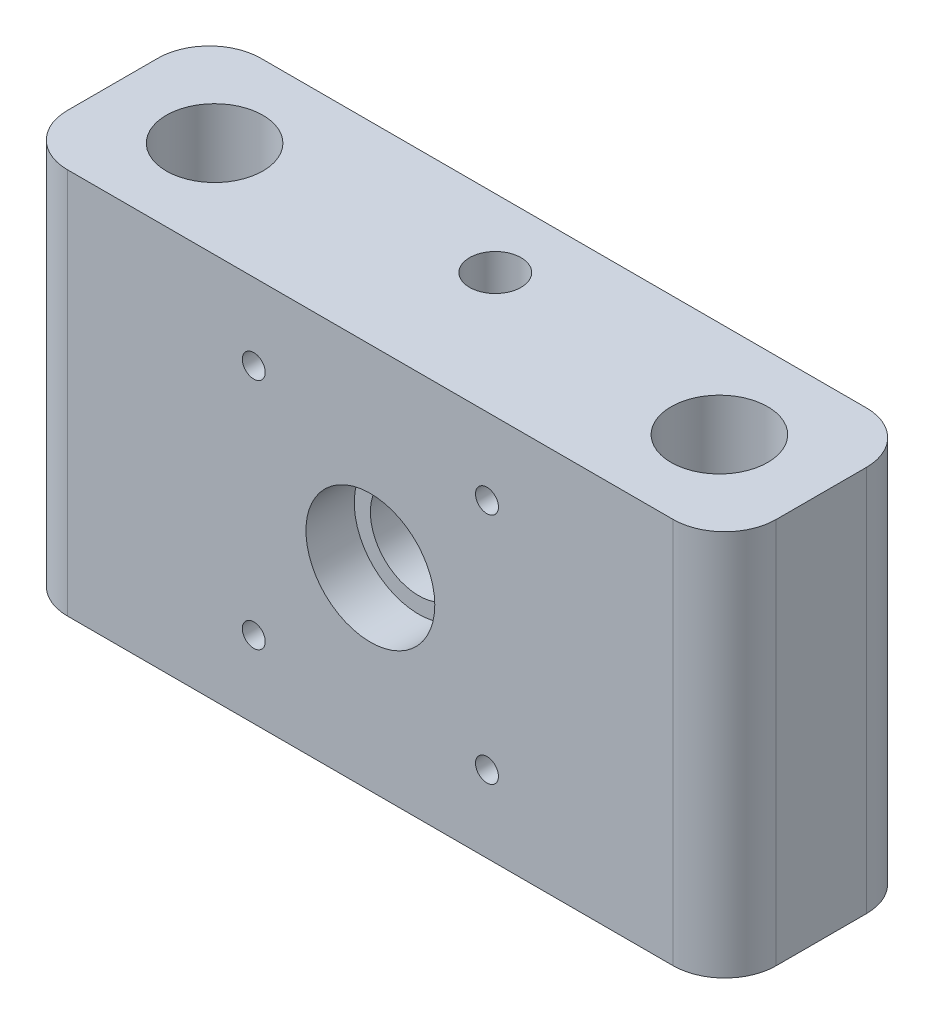
ISO-10303-21;
HEADER;
FILE_DESCRIPTION(('STEP AP214'),'2;1');
FILE_NAME('part.step','',(''),(''),'','','');
FILE_SCHEMA(('AUTOMOTIVE_DESIGN { 1 0 10303 214 1 1 1 1 }'));
ENDSEC;
DATA;
#1=APPLICATION_CONTEXT('core data for automotive mechanical design processes');
#2=APPLICATION_PROTOCOL_DEFINITION('international standard','automotive_design',2000,#1);
#3=PRODUCT_CONTEXT('',#1,'mechanical');
#4=PRODUCT('Part','Part','',(#3));
#5=PRODUCT_RELATED_PRODUCT_CATEGORY('part','',(#4));
#6=PRODUCT_DEFINITION_FORMATION('','',#4);
#7=PRODUCT_DEFINITION_CONTEXT('part definition',#1,'design');
#8=PRODUCT_DEFINITION('design','',#6,#7);
#9=PRODUCT_DEFINITION_SHAPE('','',#8);
#10=(LENGTH_UNIT() NAMED_UNIT(*) SI_UNIT(.MILLI.,.METRE.));
#11=(NAMED_UNIT(*) PLANE_ANGLE_UNIT() SI_UNIT($,.RADIAN.));
#12=(NAMED_UNIT(*) SI_UNIT($,.STERADIAN.) SOLID_ANGLE_UNIT());
#13=UNCERTAINTY_MEASURE_WITH_UNIT(LENGTH_MEASURE(1.E-05),#10,'distance_accuracy_value','');
#14=(GEOMETRIC_REPRESENTATION_CONTEXT(3) GLOBAL_UNCERTAINTY_ASSIGNED_CONTEXT((#13)) GLOBAL_UNIT_ASSIGNED_CONTEXT((#10,
#11,#12)) REPRESENTATION_CONTEXT('',''));
#15=CARTESIAN_POINT('',(0.,0.,0.));
#16=DIRECTION('',(0.,0.,1.));
#17=DIRECTION('',(1.,0.,0.));
#18=AXIS2_PLACEMENT_3D('',#15,#16,#17);
#19=CARTESIAN_POINT('',(59.8049215845028,0.,0.));
#20=DIRECTION('',(0.,1.,0.));
#21=DIRECTION('',(0.,0.,1.));
#22=AXIS2_PLACEMENT_3D('',#19,#20,#21);
#23=CYLINDRICAL_SURFACE('',#22,3.175);
#24=CARTESIAN_POINT('',(59.8049215845028,0.,0.));
#25=DIRECTION('',(0.,-1.,0.));
#26=DIRECTION('',(0.,0.,1.));
#27=AXIS2_PLACEMENT_3D('',#24,#25,#26);
#28=CIRCLE('',#27,3.175);
#29=CARTESIAN_POINT('',(59.8049215845028,0.,3.175));
#30=VERTEX_POINT('',#29);
#31=EDGE_CURVE('E184',#30,#30,#28,.T.);
#32=ORIENTED_EDGE('',*,*,#31,.T.);
#33=EDGE_LOOP('',(#32));
#34=FACE_BOUND('',#33,.T.);
#35=CARTESIAN_POINT('',(59.8049215845028,9.525,0.));
#36=DIRECTION('',(0.,1.,0.));
#37=DIRECTION('',(0.,0.,1.));
#38=AXIS2_PLACEMENT_3D('',#35,#36,#37);
#39=CIRCLE('',#38,3.175);
#40=CARTESIAN_POINT('',(59.8049215845028,9.525,3.175));
#41=VERTEX_POINT('',#40);
#42=EDGE_CURVE('E129',#41,#41,#39,.T.);
#43=ORIENTED_EDGE('',*,*,#42,.T.);
#44=EDGE_LOOP('',(#43));
#45=FACE_BOUND('',#44,.T.);
#46=ADVANCED_FACE('F33',(#34,#45),#23,.F.);
#47=CARTESIAN_POINT('',(10.0450784154972,0.,0.));
#48=DIRECTION('',(0.,1.,0.));
#49=DIRECTION('',(0.,0.,1.));
#50=AXIS2_PLACEMENT_3D('',#47,#48,#49);
#51=CYLINDRICAL_SURFACE('',#50,3.175);
#52=CARTESIAN_POINT('',(10.0450784154972,0.,0.));
#53=DIRECTION('',(0.,1.,0.));
#54=DIRECTION('',(0.,0.,1.));
#55=AXIS2_PLACEMENT_3D('',#52,#53,#54);
#56=CIRCLE('',#55,3.175);
#57=CARTESIAN_POINT('',(10.0450784154972,0.,3.175));
#58=VERTEX_POINT('',#57);
#59=EDGE_CURVE('E171',#58,#58,#56,.T.);
#60=ORIENTED_EDGE('',*,*,#59,.F.);
#61=EDGE_LOOP('',(#60));
#62=FACE_BOUND('',#61,.T.);
#63=CARTESIAN_POINT('',(10.0450784154972,9.525,0.));
#64=DIRECTION('',(0.,1.,0.));
#65=DIRECTION('',(0.,0.,1.));
#66=AXIS2_PLACEMENT_3D('',#63,#64,#65);
#67=CIRCLE('',#66,3.175);
#68=CARTESIAN_POINT('',(10.0450784154972,9.525,3.175));
#69=VERTEX_POINT('',#68);
#70=EDGE_CURVE('E169',#69,#69,#67,.F.);
#71=ORIENTED_EDGE('',*,*,#70,.F.);
#72=EDGE_LOOP('',(#71));
#73=FACE_BOUND('',#72,.T.);
#74=ADVANCED_FACE('F254',(#62,#73),#51,.F.);
#75=CARTESIAN_POINT('',(0.,0.,9.525));
#76=DIRECTION('',(1.,0.,0.));
#77=DIRECTION('',(0.,0.,-1.));
#78=AXIS2_PLACEMENT_3D('',#75,#76,#77);
#79=PLANE('',#78);
#80=DIRECTION('',(0.,0.,-1.));
#81=VECTOR('',#80,1.);
#82=CARTESIAN_POINT('',(0.,38.1,9.525));
#83=LINE('',#82,#81);
#84=CARTESIAN_POINT('',(0.,38.1,4.445));
#85=VERTEX_POINT('',#84);
#86=CARTESIAN_POINT('',(0.,38.1,-4.445));
#87=VERTEX_POINT('',#86);
#88=EDGE_CURVE('E158',#85,#87,#83,.T.);
#89=ORIENTED_EDGE('',*,*,#88,.T.);
#90=DIRECTION('',(0.,-1.,0.));
#91=VECTOR('',#90,1.);
#92=CARTESIAN_POINT('',(0.,0.,-4.445));
#93=LINE('',#92,#91);
#94=CARTESIAN_POINT('',(0.,0.,-4.445));
#95=VERTEX_POINT('',#94);
#96=EDGE_CURVE('E119',#87,#95,#93,.T.);
#97=ORIENTED_EDGE('',*,*,#96,.T.);
#98=DIRECTION('',(0.,0.,-1.));
#99=VECTOR('',#98,1.);
#100=CARTESIAN_POINT('',(0.,0.,9.525));
#101=LINE('',#100,#99);
#102=CARTESIAN_POINT('',(0.,0.,4.445));
#103=VERTEX_POINT('',#102);
#104=EDGE_CURVE('E102',#103,#95,#101,.T.);
#105=ORIENTED_EDGE('',*,*,#104,.F.);
#106=DIRECTION('',(0.,-1.,0.));
#107=VECTOR('',#106,1.);
#108=CARTESIAN_POINT('',(0.,0.,4.445));
#109=LINE('',#108,#107);
#110=EDGE_CURVE('E116',#103,#85,#109,.F.);
#111=ORIENTED_EDGE('',*,*,#110,.T.);
#112=EDGE_LOOP('',(#89,#97,#105,#111));
#113=FACE_BOUND('',#112,.T.);
#114=ADVANCED_FACE('F115',(#113),#79,.F.);
#115=CARTESIAN_POINT('',(0.,0.,9.525));
#116=DIRECTION('',(0.,1.,0.));
#117=DIRECTION('',(0.,0.,1.));
#118=AXIS2_PLACEMENT_3D('',#115,#116,#117);
#119=PLANE('',#118);
#120=ORIENTED_EDGE('',*,*,#31,.F.);
#121=EDGE_LOOP('',(#120));
#122=FACE_BOUND('',#121,.T.);
#123=ORIENTED_EDGE('',*,*,#59,.T.);
#124=EDGE_LOOP('',(#123));
#125=FACE_BOUND('',#124,.T.);
#126=ORIENTED_EDGE('',*,*,#104,.T.);
#127=CARTESIAN_POINT('',(5.08,0.,-4.445));
#128=DIRECTION('',(0.,1.,0.));
#129=DIRECTION('',(0.,0.,1.));
#130=AXIS2_PLACEMENT_3D('',#127,#128,#129);
#131=CIRCLE('',#130,5.08);
#132=CARTESIAN_POINT('',(5.08,0.,-9.525));
#133=VERTEX_POINT('',#132);
#134=EDGE_CURVE('E109',#95,#133,#131,.F.);
#135=ORIENTED_EDGE('',*,*,#134,.T.);
#136=DIRECTION('',(1.,0.,0.));
#137=VECTOR('',#136,1.);
#138=CARTESIAN_POINT('',(0.,0.,-9.525));
#139=LINE('',#138,#137);
#140=CARTESIAN_POINT('',(64.77,0.,-9.525));
#141=VERTEX_POINT('',#140);
#142=EDGE_CURVE('E217',#133,#141,#139,.T.);
#143=ORIENTED_EDGE('',*,*,#142,.T.);
#144=CARTESIAN_POINT('',(64.77,0.,-4.445));
#145=DIRECTION('',(0.,1.,0.));
#146=DIRECTION('',(0.,0.,1.));
#147=AXIS2_PLACEMENT_3D('',#144,#145,#146);
#148=CIRCLE('',#147,5.08);
#149=CARTESIAN_POINT('',(69.85,0.,-4.445));
#150=VERTEX_POINT('',#149);
#151=EDGE_CURVE('E126',#141,#150,#148,.F.);
#152=ORIENTED_EDGE('',*,*,#151,.T.);
#153=DIRECTION('',(0.,0.,-1.));
#154=VECTOR('',#153,1.);
#155=CARTESIAN_POINT('',(69.85,0.,9.525));
#156=LINE('',#155,#154);
#157=CARTESIAN_POINT('',(69.85,0.,4.445));
#158=VERTEX_POINT('',#157);
#159=EDGE_CURVE('E120',#158,#150,#156,.T.);
#160=ORIENTED_EDGE('',*,*,#159,.F.);
#161=CARTESIAN_POINT('',(64.77,0.,4.445));
#162=DIRECTION('',(0.,1.,0.));
#163=DIRECTION('',(0.,0.,1.));
#164=AXIS2_PLACEMENT_3D('',#161,#162,#163);
#165=CIRCLE('',#164,5.08);
#166=CARTESIAN_POINT('',(64.77,0.,9.525));
#167=VERTEX_POINT('',#166);
#168=EDGE_CURVE('E110',#158,#167,#165,.F.);
#169=ORIENTED_EDGE('',*,*,#168,.T.);
#170=DIRECTION('',(1.,0.,0.));
#171=VECTOR('',#170,1.);
#172=CARTESIAN_POINT('',(0.,0.,9.525));
#173=LINE('',#172,#171);
#174=CARTESIAN_POINT('',(5.08,0.,9.525));
#175=VERTEX_POINT('',#174);
#176=EDGE_CURVE('E104',#175,#167,#173,.T.);
#177=ORIENTED_EDGE('',*,*,#176,.F.);
#178=CARTESIAN_POINT('',(5.08,0.,4.445));
#179=DIRECTION('',(0.,1.,0.));
#180=DIRECTION('',(0.,0.,1.));
#181=AXIS2_PLACEMENT_3D('',#178,#179,#180);
#182=CIRCLE('',#181,5.08);
#183=EDGE_CURVE('E99',#175,#103,#182,.F.);
#184=ORIENTED_EDGE('',*,*,#183,.T.);
#185=EDGE_LOOP('',(#126,#135,#143,#152,#160,#169,#177,#184));
#186=FACE_BOUND('',#185,.T.);
#187=ADVANCED_FACE('F101',(#122,#125,#186),#119,.F.);
#188=CARTESIAN_POINT('',(69.85,0.,9.525));
#189=DIRECTION('',(-1.,0.,0.));
#190=DIRECTION('',(0.,0.,1.));
#191=AXIS2_PLACEMENT_3D('',#188,#189,#190);
#192=PLANE('',#191);
#193=DIRECTION('',(0.,0.,-1.));
#194=VECTOR('',#193,1.);
#195=CARTESIAN_POINT('',(69.85,38.1,9.525));
#196=LINE('',#195,#194);
#197=CARTESIAN_POINT('',(69.85,38.1,4.445));
#198=VERTEX_POINT('',#197);
#199=CARTESIAN_POINT('',(69.85,38.1,-4.445));
#200=VERTEX_POINT('',#199);
#201=EDGE_CURVE('E151',#198,#200,#196,.T.);
#202=ORIENTED_EDGE('',*,*,#201,.F.);
#203=DIRECTION('',(0.,1.,0.));
#204=VECTOR('',#203,1.);
#205=CARTESIAN_POINT('',(69.85,0.,4.445));
#206=LINE('',#205,#204);
#207=EDGE_CURVE('E11',#198,#158,#206,.F.);
#208=ORIENTED_EDGE('',*,*,#207,.T.);
#209=ORIENTED_EDGE('',*,*,#159,.T.);
#210=DIRECTION('',(0.,1.,0.));
#211=VECTOR('',#210,1.);
#212=CARTESIAN_POINT('',(69.85,38.1,-4.445));
#213=LINE('',#212,#211);
#214=EDGE_CURVE('E41',#150,#200,#213,.T.);
#215=ORIENTED_EDGE('',*,*,#214,.T.);
#216=EDGE_LOOP('',(#202,#208,#209,#215));
#217=FACE_BOUND('',#216,.T.);
#218=ADVANCED_FACE('F150',(#217),#192,.F.);
#219=CARTESIAN_POINT('',(0.,38.1,9.525));
#220=DIRECTION('',(0.,-1.,0.));
#221=DIRECTION('',(0.,0.,-1.));
#222=AXIS2_PLACEMENT_3D('',#219,#220,#221);
#223=PLANE('',#222);
#224=CARTESIAN_POINT('',(34.925,38.1,-2.78857927511908));
#225=DIRECTION('',(0.,1.,0.));
#226=DIRECTION('',(0.,0.,1.));
#227=AXIS2_PLACEMENT_3D('',#224,#225,#226);
#228=CIRCLE('',#227,2.54);
#229=CARTESIAN_POINT('',(34.925,38.1,-0.248579275119082));
#230=VERTEX_POINT('',#229);
#231=EDGE_CURVE('E491',#230,#230,#228,.T.);
#232=ORIENTED_EDGE('',*,*,#231,.F.);
#233=EDGE_LOOP('',(#232));
#234=FACE_BOUND('',#233,.T.);
#235=CARTESIAN_POINT('',(59.8049215845028,38.1,0.));
#236=DIRECTION('',(0.,-1.,0.));
#237=DIRECTION('',(0.,0.,1.));
#238=AXIS2_PLACEMENT_3D('',#235,#236,#237);
#239=CIRCLE('',#238,4.7625);
#240=CARTESIAN_POINT('',(59.8049215845028,38.1,4.7625));
#241=VERTEX_POINT('',#240);
#242=EDGE_CURVE('E485',#241,#241,#239,.T.);
#243=ORIENTED_EDGE('',*,*,#242,.T.);
#244=EDGE_LOOP('',(#243));
#245=FACE_BOUND('',#244,.T.);
#246=CARTESIAN_POINT('',(10.0450784154972,38.1,0.));
#247=DIRECTION('',(0.,1.,0.));
#248=DIRECTION('',(0.,0.,1.));
#249=AXIS2_PLACEMENT_3D('',#246,#247,#248);
#250=CIRCLE('',#249,4.7625);
#251=CARTESIAN_POINT('',(10.0450784154972,38.1,4.7625));
#252=VERTEX_POINT('',#251);
#253=EDGE_CURVE('E179',#252,#252,#250,.T.);
#254=ORIENTED_EDGE('',*,*,#253,.F.);
#255=EDGE_LOOP('',(#254));
#256=FACE_BOUND('',#255,.T.);
#257=DIRECTION('',(-1.,0.,0.));
#258=VECTOR('',#257,1.);
#259=CARTESIAN_POINT('',(0.,38.1,-9.525));
#260=LINE('',#259,#258);
#261=CARTESIAN_POINT('',(64.77,38.1,-9.525));
#262=VERTEX_POINT('',#261);
#263=CARTESIAN_POINT('',(5.08,38.1,-9.525));
#264=VERTEX_POINT('',#263);
#265=EDGE_CURVE('E221',#262,#264,#260,.T.);
#266=ORIENTED_EDGE('',*,*,#265,.T.);
#267=CARTESIAN_POINT('',(5.08,38.1,-4.445));
#268=DIRECTION('',(0.,-1.,0.));
#269=DIRECTION('',(0.,0.,-1.));
#270=AXIS2_PLACEMENT_3D('',#267,#268,#269);
#271=CIRCLE('',#270,5.08);
#272=EDGE_CURVE('E142',#264,#87,#271,.F.);
#273=ORIENTED_EDGE('',*,*,#272,.T.);
#274=ORIENTED_EDGE('',*,*,#88,.F.);
#275=CARTESIAN_POINT('',(5.08,38.1,4.445));
#276=DIRECTION('',(0.,-1.,0.));
#277=DIRECTION('',(0.,0.,-1.));
#278=AXIS2_PLACEMENT_3D('',#275,#276,#277);
#279=CIRCLE('',#278,5.08);
#280=CARTESIAN_POINT('',(5.08,38.1,9.525));
#281=VERTEX_POINT('',#280);
#282=EDGE_CURVE('E124',#85,#281,#279,.F.);
#283=ORIENTED_EDGE('',*,*,#282,.T.);
#284=DIRECTION('',(-1.,0.,0.));
#285=VECTOR('',#284,1.);
#286=CARTESIAN_POINT('',(0.,38.1,9.525));
#287=LINE('',#286,#285);
#288=CARTESIAN_POINT('',(64.77,38.1,9.525));
#289=VERTEX_POINT('',#288);
#290=EDGE_CURVE('E161',#289,#281,#287,.T.);
#291=ORIENTED_EDGE('',*,*,#290,.F.);
#292=CARTESIAN_POINT('',(64.77,38.1,4.445));
#293=DIRECTION('',(0.,-1.,0.));
#294=DIRECTION('',(0.,0.,-1.));
#295=AXIS2_PLACEMENT_3D('',#292,#293,#294);
#296=CIRCLE('',#295,5.08);
#297=EDGE_CURVE('E56',#289,#198,#296,.F.);
#298=ORIENTED_EDGE('',*,*,#297,.T.);
#299=ORIENTED_EDGE('',*,*,#201,.T.);
#300=CARTESIAN_POINT('',(64.77,38.1,-4.445));
#301=DIRECTION('',(0.,-1.,0.));
#302=DIRECTION('',(0.,0.,-1.));
#303=AXIS2_PLACEMENT_3D('',#300,#301,#302);
#304=CIRCLE('',#303,5.08);
#305=EDGE_CURVE('E48',#200,#262,#304,.F.);
#306=ORIENTED_EDGE('',*,*,#305,.T.);
#307=EDGE_LOOP('',(#266,#273,#274,#283,#291,#298,#299,#306));
#308=FACE_BOUND('',#307,.T.);
#309=ADVANCED_FACE('F156',(#234,#245,#256,#308),#223,.F.);
#310=CARTESIAN_POINT('',(0.,0.,9.525));
#311=DIRECTION('',(0.,0.,-1.));
#312=DIRECTION('',(-1.,0.,0.));
#313=AXIS2_PLACEMENT_3D('',#310,#311,#312);
#314=PLANE('',#313);
#315=CARTESIAN_POINT('',(23.4315,7.5565,9.525));
#316=DIRECTION('',(0.,0.,1.));
#317=DIRECTION('',(-1.,0.,0.));
#318=AXIS2_PLACEMENT_3D('',#315,#316,#317);
#319=CIRCLE('',#318,1.1303);
#320=CARTESIAN_POINT('',(22.3012,7.5565,9.525));
#321=VERTEX_POINT('',#320);
#322=EDGE_CURVE('E176',#321,#321,#319,.T.);
#323=ORIENTED_EDGE('',*,*,#322,.F.);
#324=EDGE_LOOP('',(#323));
#325=FACE_BOUND('',#324,.T.);
#326=CARTESIAN_POINT('',(46.4185,7.55649999999999,9.525));
#327=DIRECTION('',(0.,0.,1.));
#328=DIRECTION('',(1.,0.,0.));
#329=AXIS2_PLACEMENT_3D('',#326,#327,#328);
#330=CIRCLE('',#329,1.1303);
#331=CARTESIAN_POINT('',(47.5488,7.55649999999999,9.525));
#332=VERTEX_POINT('',#331);
#333=EDGE_CURVE('E199',#332,#332,#330,.T.);
#334=ORIENTED_EDGE('',*,*,#333,.F.);
#335=EDGE_LOOP('',(#334));
#336=FACE_BOUND('',#335,.T.);
#337=CARTESIAN_POINT('',(46.4185,30.5435,9.525));
#338=DIRECTION('',(0.,0.,1.));
#339=DIRECTION('',(-1.,0.,0.));
#340=AXIS2_PLACEMENT_3D('',#337,#338,#339);
#341=CIRCLE('',#340,1.1303);
#342=CARTESIAN_POINT('',(45.2882,30.5435,9.525));
#343=VERTEX_POINT('',#342);
#344=EDGE_CURVE('E193',#343,#343,#341,.T.);
#345=ORIENTED_EDGE('',*,*,#344,.F.);
#346=EDGE_LOOP('',(#345));
#347=FACE_BOUND('',#346,.T.);
#348=CARTESIAN_POINT('',(23.4315,30.5435,9.525));
#349=DIRECTION('',(0.,0.,1.));
#350=DIRECTION('',(1.,0.,0.));
#351=AXIS2_PLACEMENT_3D('',#348,#349,#350);
#352=CIRCLE('',#351,1.1303);
#353=CARTESIAN_POINT('',(24.5618,30.5435,9.525));
#354=VERTEX_POINT('',#353);
#355=EDGE_CURVE('E192',#354,#354,#352,.T.);
#356=ORIENTED_EDGE('',*,*,#355,.F.);
#357=EDGE_LOOP('',(#356));
#358=FACE_BOUND('',#357,.T.);
#359=CARTESIAN_POINT('',(34.925,19.05,9.525));
#360=DIRECTION('',(0.,0.,1.));
#361=DIRECTION('',(1.,0.,0.));
#362=AXIS2_PLACEMENT_3D('',#359,#360,#361);
#363=CIRCLE('',#362,6.35);
#364=CARTESIAN_POINT('',(41.275,19.05,9.525));
#365=VERTEX_POINT('',#364);
#366=EDGE_CURVE('E167',#365,#365,#363,.T.);
#367=ORIENTED_EDGE('',*,*,#366,.F.);
#368=EDGE_LOOP('',(#367));
#369=FACE_BOUND('',#368,.T.);
#370=ORIENTED_EDGE('',*,*,#290,.T.);
#371=DIRECTION('',(0.,-1.,0.));
#372=VECTOR('',#371,1.);
#373=CARTESIAN_POINT('',(5.08,0.,9.525));
#374=LINE('',#373,#372);
#375=EDGE_CURVE('E147',#281,#175,#374,.T.);
#376=ORIENTED_EDGE('',*,*,#375,.T.);
#377=ORIENTED_EDGE('',*,*,#176,.T.);
#378=DIRECTION('',(0.,1.,0.));
#379=VECTOR('',#378,1.);
#380=CARTESIAN_POINT('',(64.77,0.,9.525));
#381=LINE('',#380,#379);
#382=EDGE_CURVE('E144',#167,#289,#381,.T.);
#383=ORIENTED_EDGE('',*,*,#382,.T.);
#384=EDGE_LOOP('',(#370,#376,#377,#383));
#385=FACE_BOUND('',#384,.T.);
#386=ADVANCED_FACE('F237',(#325,#336,#347,#358,#369,#385),#314,.F.);
#387=CARTESIAN_POINT('',(0.,0.,-9.525));
#388=DIRECTION('',(0.,0.,-1.));
#389=DIRECTION('',(-1.,0.,0.));
#390=AXIS2_PLACEMENT_3D('',#387,#388,#389);
#391=PLANE('',#390);
#392=CARTESIAN_POINT('',(23.4315,7.5565,-9.525));
#393=DIRECTION('',(0.,0.,1.));
#394=DIRECTION('',(-1.,0.,0.));
#395=AXIS2_PLACEMENT_3D('',#392,#393,#394);
#396=CIRCLE('',#395,1.1303);
#397=CARTESIAN_POINT('',(22.3012,7.5565,-9.525));
#398=VERTEX_POINT('',#397);
#399=EDGE_CURVE('E202',#398,#398,#396,.T.);
#400=ORIENTED_EDGE('',*,*,#399,.T.);
#401=EDGE_LOOP('',(#400));
#402=FACE_BOUND('',#401,.T.);
#403=CARTESIAN_POINT('',(46.4185,7.55649999999999,-9.525));
#404=DIRECTION('',(0.,0.,1.));
#405=DIRECTION('',(1.,0.,0.));
#406=AXIS2_PLACEMENT_3D('',#403,#404,#405);
#407=CIRCLE('',#406,1.1303);
#408=CARTESIAN_POINT('',(47.5488,7.55649999999999,-9.525));
#409=VERTEX_POINT('',#408);
#410=EDGE_CURVE('E196',#409,#409,#407,.T.);
#411=ORIENTED_EDGE('',*,*,#410,.T.);
#412=EDGE_LOOP('',(#411));
#413=FACE_BOUND('',#412,.T.);
#414=CARTESIAN_POINT('',(46.4185,30.5435,-9.525));
#415=DIRECTION('',(0.,0.,1.));
#416=DIRECTION('',(-1.,0.,0.));
#417=AXIS2_PLACEMENT_3D('',#414,#415,#416);
#418=CIRCLE('',#417,1.1303);
#419=CARTESIAN_POINT('',(45.2882,30.5435,-9.525));
#420=VERTEX_POINT('',#419);
#421=EDGE_CURVE('E189',#420,#420,#418,.T.);
#422=ORIENTED_EDGE('',*,*,#421,.T.);
#423=EDGE_LOOP('',(#422));
#424=FACE_BOUND('',#423,.T.);
#425=CARTESIAN_POINT('',(23.4315,30.5435,-9.525));
#426=DIRECTION('',(0.,0.,1.));
#427=DIRECTION('',(1.,0.,0.));
#428=AXIS2_PLACEMENT_3D('',#425,#426,#427);
#429=CIRCLE('',#428,1.1303);
#430=CARTESIAN_POINT('',(24.5618,30.5435,-9.525));
#431=VERTEX_POINT('',#430);
#432=EDGE_CURVE('E207',#431,#431,#429,.T.);
#433=ORIENTED_EDGE('',*,*,#432,.T.);
#434=EDGE_LOOP('',(#433));
#435=FACE_BOUND('',#434,.T.);
#436=CARTESIAN_POINT('',(34.925,19.05,-9.525));
#437=DIRECTION('',(0.,0.,1.));
#438=DIRECTION('',(1.,0.,0.));
#439=AXIS2_PLACEMENT_3D('',#436,#437,#438);
#440=CIRCLE('',#439,4.7625);
#441=CARTESIAN_POINT('',(39.6875,19.05,-9.525));
#442=VERTEX_POINT('',#441);
#443=EDGE_CURVE('E168',#442,#442,#440,.T.);
#444=ORIENTED_EDGE('',*,*,#443,.T.);
#445=EDGE_LOOP('',(#444));
#446=FACE_BOUND('',#445,.T.);
#447=ORIENTED_EDGE('',*,*,#142,.F.);
#448=DIRECTION('',(0.,-1.,0.));
#449=VECTOR('',#448,1.);
#450=CARTESIAN_POINT('',(5.08,38.1,-9.525));
#451=LINE('',#450,#449);
#452=EDGE_CURVE('E137',#133,#264,#451,.F.);
#453=ORIENTED_EDGE('',*,*,#452,.T.);
#454=ORIENTED_EDGE('',*,*,#265,.F.);
#455=DIRECTION('',(0.,1.,0.));
#456=VECTOR('',#455,1.);
#457=CARTESIAN_POINT('',(64.77,0.,-9.525));
#458=LINE('',#457,#456);
#459=EDGE_CURVE('E135',#262,#141,#458,.F.);
#460=ORIENTED_EDGE('',*,*,#459,.T.);
#461=EDGE_LOOP('',(#447,#453,#454,#460));
#462=FACE_BOUND('',#461,.T.);
#463=ADVANCED_FACE('F231',(#402,#413,#424,#435,#446,#462),#391,.T.);
#464=CARTESIAN_POINT('',(34.925,19.05,4.7625));
#465=DIRECTION('',(0.,0.,1.));
#466=DIRECTION('',(1.,0.,0.));
#467=AXIS2_PLACEMENT_3D('',#464,#465,#466);
#468=CYLINDRICAL_SURFACE('',#467,6.35);
#469=CARTESIAN_POINT('',(34.925,19.05,4.7625));
#470=DIRECTION('',(0.,0.,1.));
#471=DIRECTION('',(1.,0.,0.));
#472=AXIS2_PLACEMENT_3D('',#469,#470,#471);
#473=CIRCLE('',#472,6.35);
#474=CARTESIAN_POINT('',(41.275,19.05,4.7625));
#475=VERTEX_POINT('',#474);
#476=EDGE_CURVE('E214',#475,#475,#473,.T.);
#477=ORIENTED_EDGE('',*,*,#476,.F.);
#478=EDGE_LOOP('',(#477));
#479=FACE_BOUND('',#478,.T.);
#480=ORIENTED_EDGE('',*,*,#366,.T.);
#481=EDGE_LOOP('',(#480));
#482=FACE_BOUND('',#481,.T.);
#483=ADVANCED_FACE('F245',(#479,#482),#468,.F.);
#484=CARTESIAN_POINT('',(34.925,19.05,4.7625));
#485=DIRECTION('',(0.,0.,1.));
#486=DIRECTION('',(1.,0.,0.));
#487=AXIS2_PLACEMENT_3D('',#484,#485,#486);
#488=PLANE('',#487);
#489=CARTESIAN_POINT('',(34.925,19.05,4.7625));
#490=DIRECTION('',(0.,0.,1.));
#491=DIRECTION('',(1.,0.,0.));
#492=AXIS2_PLACEMENT_3D('',#489,#490,#491);
#493=CIRCLE('',#492,4.7625);
#494=CARTESIAN_POINT('',(39.6875,19.05,4.7625));
#495=VERTEX_POINT('',#494);
#496=EDGE_CURVE('E165',#495,#495,#493,.T.);
#497=ORIENTED_EDGE('',*,*,#496,.F.);
#498=EDGE_LOOP('',(#497));
#499=FACE_BOUND('',#498,.T.);
#500=ORIENTED_EDGE('',*,*,#476,.T.);
#501=EDGE_LOOP('',(#500));
#502=FACE_BOUND('',#501,.T.);
#503=ADVANCED_FACE('F294',(#499,#502),#488,.T.);
#504=CARTESIAN_POINT('',(34.925,19.05,-9.525));
#505=DIRECTION('',(0.,0.,1.));
#506=DIRECTION('',(1.,0.,0.));
#507=AXIS2_PLACEMENT_3D('',#504,#505,#506);
#508=CYLINDRICAL_SURFACE('',#507,4.7625);
#509=ORIENTED_EDGE('',*,*,#496,.T.);
#510=EDGE_LOOP('',(#509));
#511=FACE_BOUND('',#510,.T.);
#512=ORIENTED_EDGE('',*,*,#443,.F.);
#513=EDGE_LOOP('',(#512));
#514=FACE_BOUND('',#513,.T.);
#515=ADVANCED_FACE('F290',(#511,#514),#508,.F.);
#516=CARTESIAN_POINT('',(23.4315,30.5435,-9.525));
#517=DIRECTION('',(0.,0.,1.));
#518=DIRECTION('',(1.,0.,0.));
#519=AXIS2_PLACEMENT_3D('',#516,#517,#518);
#520=CYLINDRICAL_SURFACE('',#519,1.1303);
#521=ORIENTED_EDGE('',*,*,#432,.F.);
#522=EDGE_LOOP('',(#521));
#523=FACE_BOUND('',#522,.T.);
#524=ORIENTED_EDGE('',*,*,#355,.T.);
#525=EDGE_LOOP('',(#524));
#526=FACE_BOUND('',#525,.T.);
#527=ADVANCED_FACE('F280',(#523,#526),#520,.F.);
#528=CARTESIAN_POINT('',(46.4185,30.5435,-9.525));
#529=DIRECTION('',(0.,0.,1.));
#530=DIRECTION('',(1.,0.,0.));
#531=AXIS2_PLACEMENT_3D('',#528,#529,#530);
#532=CYLINDRICAL_SURFACE('',#531,1.1303);
#533=ORIENTED_EDGE('',*,*,#421,.F.);
#534=EDGE_LOOP('',(#533));
#535=FACE_BOUND('',#534,.T.);
#536=ORIENTED_EDGE('',*,*,#344,.T.);
#537=EDGE_LOOP('',(#536));
#538=FACE_BOUND('',#537,.T.);
#539=ADVANCED_FACE('F276',(#535,#538),#532,.F.);
#540=CARTESIAN_POINT('',(46.4185,7.55649999999999,-9.525));
#541=DIRECTION('',(0.,0.,1.));
#542=DIRECTION('',(1.,0.,0.));
#543=AXIS2_PLACEMENT_3D('',#540,#541,#542);
#544=CYLINDRICAL_SURFACE('',#543,1.1303);
#545=ORIENTED_EDGE('',*,*,#410,.F.);
#546=EDGE_LOOP('',(#545));
#547=FACE_BOUND('',#546,.T.);
#548=ORIENTED_EDGE('',*,*,#333,.T.);
#549=EDGE_LOOP('',(#548));
#550=FACE_BOUND('',#549,.T.);
#551=ADVANCED_FACE('F279',(#547,#550),#544,.F.);
#552=CARTESIAN_POINT('',(23.4315,7.5565,-9.525));
#553=DIRECTION('',(0.,0.,1.));
#554=DIRECTION('',(1.,0.,0.));
#555=AXIS2_PLACEMENT_3D('',#552,#553,#554);
#556=CYLINDRICAL_SURFACE('',#555,1.1303);
#557=ORIENTED_EDGE('',*,*,#399,.F.);
#558=EDGE_LOOP('',(#557));
#559=FACE_BOUND('',#558,.T.);
#560=ORIENTED_EDGE('',*,*,#322,.T.);
#561=EDGE_LOOP('',(#560));
#562=FACE_BOUND('',#561,.T.);
#563=ADVANCED_FACE('F272',(#559,#562),#556,.F.);
#564=CARTESIAN_POINT('',(10.0450784154972,9.525,0.));
#565=DIRECTION('',(0.,1.,0.));
#566=DIRECTION('',(0.,0.,1.));
#567=AXIS2_PLACEMENT_3D('',#564,#565,#566);
#568=PLANE('',#567);
#569=CARTESIAN_POINT('',(10.0450784154972,9.525,0.));
#570=DIRECTION('',(0.,1.,0.));
#571=DIRECTION('',(0.,0.,1.));
#572=AXIS2_PLACEMENT_3D('',#569,#570,#571);
#573=CIRCLE('',#572,4.7625);
#574=CARTESIAN_POINT('',(10.0450784154972,9.525,4.7625));
#575=VERTEX_POINT('',#574);
#576=EDGE_CURVE('E172',#575,#575,#573,.T.);
#577=ORIENTED_EDGE('',*,*,#576,.T.);
#578=EDGE_LOOP('',(#577));
#579=FACE_BOUND('',#578,.T.);
#580=ORIENTED_EDGE('',*,*,#70,.T.);
#581=EDGE_LOOP('',(#580));
#582=FACE_BOUND('',#581,.T.);
#583=ADVANCED_FACE('F268',(#579,#582),#568,.T.);
#584=CARTESIAN_POINT('',(10.0450784154972,9.525,0.));
#585=DIRECTION('',(0.,1.,0.));
#586=DIRECTION('',(0.,0.,1.));
#587=AXIS2_PLACEMENT_3D('',#584,#585,#586);
#588=CYLINDRICAL_SURFACE('',#587,4.7625);
#589=ORIENTED_EDGE('',*,*,#576,.F.);
#590=EDGE_LOOP('',(#589));
#591=FACE_BOUND('',#590,.T.);
#592=ORIENTED_EDGE('',*,*,#253,.T.);
#593=EDGE_LOOP('',(#592));
#594=FACE_BOUND('',#593,.T.);
#595=ADVANCED_FACE('F271',(#591,#594),#588,.F.);
#596=CARTESIAN_POINT('',(59.8049215845028,9.525,0.));
#597=DIRECTION('',(0.,1.,0.));
#598=DIRECTION('',(0.,0.,1.));
#599=AXIS2_PLACEMENT_3D('',#596,#597,#598);
#600=CYLINDRICAL_SURFACE('',#599,4.7625);
#601=CARTESIAN_POINT('',(59.8049215845028,9.525,0.));
#602=DIRECTION('',(0.,-1.,0.));
#603=DIRECTION('',(0.,0.,1.));
#604=AXIS2_PLACEMENT_3D('',#601,#602,#603);
#605=CIRCLE('',#604,4.7625);
#606=CARTESIAN_POINT('',(59.8049215845028,9.525,4.7625));
#607=VERTEX_POINT('',#606);
#608=EDGE_CURVE('E482',#607,#607,#605,.T.);
#609=ORIENTED_EDGE('',*,*,#608,.T.);
#610=EDGE_LOOP('',(#609));
#611=FACE_BOUND('',#610,.T.);
#612=ORIENTED_EDGE('',*,*,#242,.F.);
#613=EDGE_LOOP('',(#612));
#614=FACE_BOUND('',#613,.T.);
#615=ADVANCED_FACE('F266',(#611,#614),#600,.F.);
#616=CARTESIAN_POINT('',(59.8049215845028,9.525,0.));
#617=DIRECTION('',(0.,1.,0.));
#618=DIRECTION('',(0.,0.,1.));
#619=AXIS2_PLACEMENT_3D('',#616,#617,#618);
#620=PLANE('',#619);
#621=ORIENTED_EDGE('',*,*,#42,.F.);
#622=EDGE_LOOP('',(#621));
#623=FACE_BOUND('',#622,.T.);
#624=ORIENTED_EDGE('',*,*,#608,.F.);
#625=EDGE_LOOP('',(#624));
#626=FACE_BOUND('',#625,.T.);
#627=ADVANCED_FACE('F348',(#623,#626),#620,.T.);
#628=CARTESIAN_POINT('',(34.925,28.448,-2.78857927511908));
#629=DIRECTION('',(0.,1.,0.));
#630=DIRECTION('',(0.,0.,1.));
#631=AXIS2_PLACEMENT_3D('',#628,#629,#630);
#632=CYLINDRICAL_SURFACE('',#631,2.54);
#633=CARTESIAN_POINT('',(34.925,28.448,-2.78857927511908));
#634=DIRECTION('',(0.,1.,0.));
#635=DIRECTION('',(0.,0.,1.));
#636=AXIS2_PLACEMENT_3D('',#633,#634,#635);
#637=CIRCLE('',#636,2.54);
#638=CARTESIAN_POINT('',(34.925,28.448,-0.248579275119082));
#639=VERTEX_POINT('',#638);
#640=EDGE_CURVE('E489',#639,#639,#637,.T.);
#641=ORIENTED_EDGE('',*,*,#640,.F.);
#642=EDGE_LOOP('',(#641));
#643=FACE_BOUND('',#642,.T.);
#644=ORIENTED_EDGE('',*,*,#231,.T.);
#645=EDGE_LOOP('',(#644));
#646=FACE_BOUND('',#645,.T.);
#647=ADVANCED_FACE('F355',(#643,#646),#632,.F.);
#648=CARTESIAN_POINT('',(34.925,28.448,-2.78857927511908));
#649=DIRECTION('',(0.,1.,0.));
#650=DIRECTION('',(0.,0.,1.));
#651=AXIS2_PLACEMENT_3D('',#648,#649,#650);
#652=PLANE('',#651);
#653=ORIENTED_EDGE('',*,*,#640,.T.);
#654=EDGE_LOOP('',(#653));
#655=FACE_BOUND('',#654,.T.);
#656=ADVANCED_FACE('F362',(#655),#652,.T.);
#657=CARTESIAN_POINT('',(5.08,0.,-4.445));
#658=DIRECTION('',(0.,1.,0.));
#659=DIRECTION('',(0.,0.,1.));
#660=AXIS2_PLACEMENT_3D('',#657,#658,#659);
#661=CYLINDRICAL_SURFACE('',#660,5.08);
#662=ORIENTED_EDGE('',*,*,#272,.F.);
#663=ORIENTED_EDGE('',*,*,#452,.F.);
#664=ORIENTED_EDGE('',*,*,#134,.F.);
#665=ORIENTED_EDGE('',*,*,#96,.F.);
#666=EDGE_LOOP('',(#662,#663,#664,#665));
#667=FACE_BOUND('',#666,.T.);
#668=ADVANCED_FACE('F229',(#667),#661,.T.);
#669=CARTESIAN_POINT('',(5.08,0.,4.445));
#670=DIRECTION('',(0.,-1.,0.));
#671=DIRECTION('',(0.,0.,-1.));
#672=AXIS2_PLACEMENT_3D('',#669,#670,#671);
#673=CYLINDRICAL_SURFACE('',#672,5.08);
#674=ORIENTED_EDGE('',*,*,#282,.F.);
#675=ORIENTED_EDGE('',*,*,#110,.F.);
#676=ORIENTED_EDGE('',*,*,#183,.F.);
#677=ORIENTED_EDGE('',*,*,#375,.F.);
#678=EDGE_LOOP('',(#674,#675,#676,#677));
#679=FACE_BOUND('',#678,.T.);
#680=ADVANCED_FACE('F123',(#679),#673,.T.);
#681=CARTESIAN_POINT('',(64.77,0.,4.445));
#682=DIRECTION('',(0.,1.,0.));
#683=DIRECTION('',(0.,0.,1.));
#684=AXIS2_PLACEMENT_3D('',#681,#682,#683);
#685=CYLINDRICAL_SURFACE('',#684,5.08);
#686=ORIENTED_EDGE('',*,*,#168,.F.);
#687=ORIENTED_EDGE('',*,*,#207,.F.);
#688=ORIENTED_EDGE('',*,*,#297,.F.);
#689=ORIENTED_EDGE('',*,*,#382,.F.);
#690=EDGE_LOOP('',(#686,#687,#688,#689));
#691=FACE_BOUND('',#690,.T.);
#692=ADVANCED_FACE('F235',(#691),#685,.T.);
#693=CARTESIAN_POINT('',(64.77,0.,-4.445));
#694=DIRECTION('',(0.,-1.,0.));
#695=DIRECTION('',(0.,0.,-1.));
#696=AXIS2_PLACEMENT_3D('',#693,#694,#695);
#697=CYLINDRICAL_SURFACE('',#696,5.08);
#698=ORIENTED_EDGE('',*,*,#151,.F.);
#699=ORIENTED_EDGE('',*,*,#459,.F.);
#700=ORIENTED_EDGE('',*,*,#305,.F.);
#701=ORIENTED_EDGE('',*,*,#214,.F.);
#702=EDGE_LOOP('',(#698,#699,#700,#701));
#703=FACE_BOUND('',#702,.T.);
#704=ADVANCED_FACE('F35',(#703),#697,.T.);
#705=CLOSED_SHELL('',(#46,#74,#114,#187,#218,#309,#386,#463,#483,#503,#515,#527,#539,#551,#563,
#583,#595,#615,#627,#647,#656,#668,#680,#692,#704));
#706=MANIFOLD_SOLID_BREP('B2',#705);
#707=ADVANCED_BREP_SHAPE_REPRESENTATION('',(#18,#706),#14);
#708=SHAPE_DEFINITION_REPRESENTATION(#9,#707);
ENDSEC;
END-ISO-10303-21;
